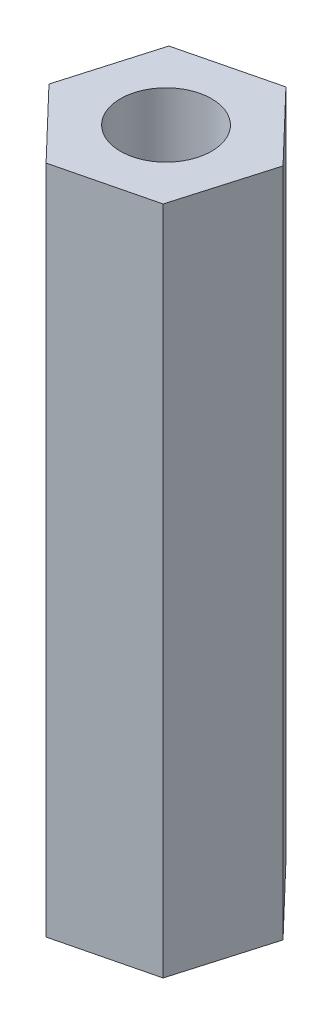
ISO-10303-21;
HEADER;
FILE_DESCRIPTION(('STEP AP214'),'2;1');
FILE_NAME('part.step','',(''),(''),'','','');
FILE_SCHEMA(('AUTOMOTIVE_DESIGN { 1 0 10303 214 1 1 1 1 }'));
ENDSEC;
DATA;
#1=APPLICATION_CONTEXT('core data for automotive mechanical design processes');
#2=APPLICATION_PROTOCOL_DEFINITION('international standard','automotive_design',2000,#1);
#3=PRODUCT_CONTEXT('',#1,'mechanical');
#4=PRODUCT('Part','Part','',(#3));
#5=PRODUCT_RELATED_PRODUCT_CATEGORY('part','',(#4));
#6=PRODUCT_DEFINITION_FORMATION('','',#4);
#7=PRODUCT_DEFINITION_CONTEXT('part definition',#1,'design');
#8=PRODUCT_DEFINITION('design','',#6,#7);
#9=PRODUCT_DEFINITION_SHAPE('','',#8);
#10=(LENGTH_UNIT() NAMED_UNIT(*) SI_UNIT(.MILLI.,.METRE.));
#11=(NAMED_UNIT(*) PLANE_ANGLE_UNIT() SI_UNIT($,.RADIAN.));
#12=(NAMED_UNIT(*) SI_UNIT($,.STERADIAN.) SOLID_ANGLE_UNIT());
#13=UNCERTAINTY_MEASURE_WITH_UNIT(LENGTH_MEASURE(1.E-05),#10,'distance_accuracy_value','');
#14=(GEOMETRIC_REPRESENTATION_CONTEXT(3) GLOBAL_UNCERTAINTY_ASSIGNED_CONTEXT((#13)) GLOBAL_UNIT_ASSIGNED_CONTEXT((#10,
#11,#12)) REPRESENTATION_CONTEXT('',''));
#15=CARTESIAN_POINT('',(0.,0.,0.));
#16=DIRECTION('',(0.,0.,1.));
#17=DIRECTION('',(1.,0.,0.));
#18=AXIS2_PLACEMENT_3D('',#15,#16,#17);
#19=CARTESIAN_POINT('',(-6.32811130994487,25.4,-2.46052037020981));
#20=DIRECTION('',(-0.238502387947703,0.,-0.971141910815944));
#21=DIRECTION('',(-0.971141910815944,0.,0.238502387947703));
#22=AXIS2_PLACEMENT_3D('',#19,#20,#21);
#23=PLANE('',#22);
#24=DIRECTION('',(0.971141910815944,0.,-0.238502387947703));
#25=VECTOR('',#24,1.);
#26=CARTESIAN_POINT('',(-6.32811130994487,0.,-2.46052037020981));
#27=LINE('',#26,#25);
#28=CARTESIAN_POINT('',(-6.32811130994487,0.,-2.46052037020981));
#29=VERTEX_POINT('',#28);
#30=CARTESIAN_POINT('',(-2.76773588288857,0.,-3.33491167377304));
#31=VERTEX_POINT('',#30);
#32=EDGE_CURVE('E121',#29,#31,#27,.T.);
#33=ORIENTED_EDGE('',*,*,#32,.T.);
#34=DIRECTION('',(0.,-1.,0.));
#35=VECTOR('',#34,1.);
#36=CARTESIAN_POINT('',(-2.76773588288857,25.4,-3.33491167377304));
#37=LINE('',#36,#35);
#38=CARTESIAN_POINT('',(-2.76773588288857,25.4,-3.33491167377304));
#39=VERTEX_POINT('',#38);
#40=EDGE_CURVE('E11',#39,#31,#37,.T.);
#41=ORIENTED_EDGE('',*,*,#40,.F.);
#42=DIRECTION('',(0.971141910815944,0.,-0.238502387947703));
#43=VECTOR('',#42,1.);
#44=CARTESIAN_POINT('',(-6.32811130994487,25.4,-2.46052037020981));
#45=LINE('',#44,#43);
#46=CARTESIAN_POINT('',(-6.32811130994487,25.4,-2.46052037020981));
#47=VERTEX_POINT('',#46);
#48=EDGE_CURVE('E132',#47,#39,#45,.T.);
#49=ORIENTED_EDGE('',*,*,#48,.F.);
#50=DIRECTION('',(0.,-1.,0.));
#51=VECTOR('',#50,1.);
#52=CARTESIAN_POINT('',(-6.32811130994487,25.4,-2.46052037020981));
#53=LINE('',#52,#51);
#54=EDGE_CURVE('E117',#47,#29,#53,.T.);
#55=ORIENTED_EDGE('',*,*,#54,.T.);
#56=EDGE_LOOP('',(#33,#41,#49,#55));
#57=FACE_BOUND('',#56,.T.);
#58=ADVANCED_FACE('F37',(#57),#23,.F.);
#59=CARTESIAN_POINT('',(-2.76773588288857,25.4,-3.33491167377304));
#60=DIRECTION('',(-0.960284759420221,0.,-0.279021828582011));
#61=DIRECTION('',(-0.279021828582011,0.,0.960284759420221));
#62=AXIS2_PLACEMENT_3D('',#59,#60,#61);
#63=PLANE('',#62);
#64=DIRECTION('',(0.279021828582011,0.,-0.960284759420221));
#65=VECTOR('',#64,1.);
#66=CARTESIAN_POINT('',(-2.76773588288857,0.,-3.33491167377304));
#67=LINE('',#66,#65);
#68=CARTESIAN_POINT('',(-1.74479325109438,0.,-6.85548289239529));
#69=VERTEX_POINT('',#68);
#70=EDGE_CURVE('E124',#31,#69,#67,.T.);
#71=ORIENTED_EDGE('',*,*,#70,.T.);
#72=DIRECTION('',(0.,-1.,0.));
#73=VECTOR('',#72,1.);
#74=CARTESIAN_POINT('',(-1.74479325109438,25.4,-6.85548289239529));
#75=LINE('',#74,#73);
#76=CARTESIAN_POINT('',(-1.74479325109438,25.4,-6.85548289239529));
#77=VERTEX_POINT('',#76);
#78=EDGE_CURVE('E45',#77,#69,#75,.T.);
#79=ORIENTED_EDGE('',*,*,#78,.F.);
#80=DIRECTION('',(0.279021828582011,0.,-0.960284759420221));
#81=VECTOR('',#80,1.);
#82=CARTESIAN_POINT('',(-2.76773588288857,25.4,-3.33491167377304));
#83=LINE('',#82,#81);
#84=EDGE_CURVE('E90',#39,#77,#83,.T.);
#85=ORIENTED_EDGE('',*,*,#84,.F.);
#86=ORIENTED_EDGE('',*,*,#40,.T.);
#87=EDGE_LOOP('',(#71,#79,#85,#86));
#88=FACE_BOUND('',#87,.T.);
#89=ADVANCED_FACE('F157',(#88),#63,.F.);
#90=CARTESIAN_POINT('',(-1.74479325109438,25.4,-6.85548289239529));
#91=DIRECTION('',(-0.721782371472518,0.,0.692120082233934));
#92=DIRECTION('',(0.692120082233934,0.,0.721782371472518));
#93=AXIS2_PLACEMENT_3D('',#90,#91,#92);
#94=PLANE('',#93);
#95=DIRECTION('',(-0.692120082233934,0.,-0.721782371472518));
#96=VECTOR('',#95,1.);
#97=CARTESIAN_POINT('',(-1.74479325109438,0.,-6.85548289239529));
#98=LINE('',#97,#96);
#99=CARTESIAN_POINT('',(-4.28222604635648,0.,-9.50166280745429));
#100=VERTEX_POINT('',#99);
#101=EDGE_CURVE('E127',#69,#100,#98,.T.);
#102=ORIENTED_EDGE('',*,*,#101,.T.);
#103=DIRECTION('',(0.,-1.,0.));
#104=VECTOR('',#103,1.);
#105=CARTESIAN_POINT('',(-4.28222604635648,25.4,-9.50166280745429));
#106=LINE('',#105,#104);
#107=CARTESIAN_POINT('',(-4.28222604635648,25.4,-9.50166280745429));
#108=VERTEX_POINT('',#107);
#109=EDGE_CURVE('E112',#108,#100,#106,.T.);
#110=ORIENTED_EDGE('',*,*,#109,.F.);
#111=DIRECTION('',(-0.692120082233934,0.,-0.721782371472518));
#112=VECTOR('',#111,1.);
#113=CARTESIAN_POINT('',(-1.74479325109438,25.4,-6.85548289239529));
#114=LINE('',#113,#112);
#115=EDGE_CURVE('E103',#77,#108,#114,.T.);
#116=ORIENTED_EDGE('',*,*,#115,.F.);
#117=ORIENTED_EDGE('',*,*,#78,.T.);
#118=EDGE_LOOP('',(#102,#110,#116,#117));
#119=FACE_BOUND('',#118,.T.);
#120=ADVANCED_FACE('F138',(#119),#94,.F.);
#121=CARTESIAN_POINT('',(-4.28222604635648,25.4,-9.50166280745429));
#122=DIRECTION('',(0.238502387947701,0.,0.971141910815945));
#123=DIRECTION('',(0.971141910815945,0.,-0.238502387947701));
#124=AXIS2_PLACEMENT_3D('',#121,#122,#123);
#125=PLANE('',#124);
#126=DIRECTION('',(-0.971141910815945,0.,0.238502387947701));
#127=VECTOR('',#126,1.);
#128=CARTESIAN_POINT('',(-4.28222604635648,0.,-9.50166280745429));
#129=LINE('',#128,#127);
#130=CARTESIAN_POINT('',(-7.84260147341278,0.,-8.62727150389105));
#131=VERTEX_POINT('',#130);
#132=EDGE_CURVE('E111',#100,#131,#129,.T.);
#133=ORIENTED_EDGE('',*,*,#132,.T.);
#134=DIRECTION('',(0.,-1.,0.));
#135=VECTOR('',#134,1.);
#136=CARTESIAN_POINT('',(-7.84260147341278,25.4,-8.62727150389105));
#137=LINE('',#136,#135);
#138=CARTESIAN_POINT('',(-7.84260147341278,25.4,-8.62727150389105));
#139=VERTEX_POINT('',#138);
#140=EDGE_CURVE('E108',#139,#131,#137,.T.);
#141=ORIENTED_EDGE('',*,*,#140,.F.);
#142=DIRECTION('',(-0.971141910815945,0.,0.238502387947701));
#143=VECTOR('',#142,1.);
#144=CARTESIAN_POINT('',(-4.28222604635648,25.4,-9.50166280745429));
#145=LINE('',#144,#143);
#146=EDGE_CURVE('E97',#108,#139,#145,.T.);
#147=ORIENTED_EDGE('',*,*,#146,.F.);
#148=ORIENTED_EDGE('',*,*,#109,.T.);
#149=EDGE_LOOP('',(#133,#141,#147,#148));
#150=FACE_BOUND('',#149,.T.);
#151=ADVANCED_FACE('F109',(#150),#125,.F.);
#152=CARTESIAN_POINT('',(-7.84260147341278,25.4,-8.62727150389105));
#153=DIRECTION('',(0.960284759420221,0.,0.27902182858201));
#154=DIRECTION('',(0.27902182858201,0.,-0.960284759420221));
#155=AXIS2_PLACEMENT_3D('',#152,#153,#154);
#156=PLANE('',#155);
#157=DIRECTION('',(-0.27902182858201,0.,0.960284759420221));
#158=VECTOR('',#157,1.);
#159=CARTESIAN_POINT('',(-7.84260147341278,0.,-8.62727150389105));
#160=LINE('',#159,#158);
#161=CARTESIAN_POINT('',(-8.86554410520697,0.,-5.10670028526881));
#162=VERTEX_POINT('',#161);
#163=EDGE_CURVE('E76',#131,#162,#160,.T.);
#164=ORIENTED_EDGE('',*,*,#163,.T.);
#165=DIRECTION('',(0.,-1.,0.));
#166=VECTOR('',#165,1.);
#167=CARTESIAN_POINT('',(-8.86554410520697,25.4,-5.10670028526881));
#168=LINE('',#167,#166);
#169=CARTESIAN_POINT('',(-8.86554410520697,25.4,-5.10670028526881));
#170=VERTEX_POINT('',#169);
#171=EDGE_CURVE('E113',#170,#162,#168,.T.);
#172=ORIENTED_EDGE('',*,*,#171,.F.);
#173=DIRECTION('',(-0.27902182858201,0.,0.960284759420221));
#174=VECTOR('',#173,1.);
#175=CARTESIAN_POINT('',(-7.84260147341278,25.4,-8.62727150389105));
#176=LINE('',#175,#174);
#177=EDGE_CURVE('E101',#139,#170,#176,.T.);
#178=ORIENTED_EDGE('',*,*,#177,.F.);
#179=ORIENTED_EDGE('',*,*,#140,.T.);
#180=EDGE_LOOP('',(#164,#172,#178,#179));
#181=FACE_BOUND('',#180,.T.);
#182=ADVANCED_FACE('F115',(#181),#156,.F.);
#183=CARTESIAN_POINT('',(-8.86554410520697,25.4,-5.10670028526881));
#184=DIRECTION('',(0.721782371472518,0.,-0.692120082233934));
#185=DIRECTION('',(-0.692120082233934,0.,-0.721782371472518));
#186=AXIS2_PLACEMENT_3D('',#183,#184,#185);
#187=PLANE('',#186);
#188=DIRECTION('',(0.692120082233934,0.,0.721782371472518));
#189=VECTOR('',#188,1.);
#190=CARTESIAN_POINT('',(-8.86554410520697,0.,-5.10670028526881));
#191=LINE('',#190,#189);
#192=EDGE_CURVE('E82',#162,#29,#191,.T.);
#193=ORIENTED_EDGE('',*,*,#192,.T.);
#194=ORIENTED_EDGE('',*,*,#54,.F.);
#195=DIRECTION('',(0.692120082233934,0.,0.721782371472518));
#196=VECTOR('',#195,1.);
#197=CARTESIAN_POINT('',(-8.86554410520697,25.4,-5.10670028526881));
#198=LINE('',#197,#196);
#199=EDGE_CURVE('E53',#170,#47,#198,.T.);
#200=ORIENTED_EDGE('',*,*,#199,.F.);
#201=ORIENTED_EDGE('',*,*,#171,.T.);
#202=EDGE_LOOP('',(#193,#194,#200,#201));
#203=FACE_BOUND('',#202,.T.);
#204=ADVANCED_FACE('F145',(#203),#187,.F.);
#205=CARTESIAN_POINT('',(0.,25.4,0.));
#206=DIRECTION('',(0.,1.,0.));
#207=DIRECTION('',(0.,0.,1.));
#208=AXIS2_PLACEMENT_3D('',#205,#206,#207);
#209=PLANE('',#208);
#210=CARTESIAN_POINT('',(-5.30516867815067,25.4,-5.98109158883205));
#211=DIRECTION('',(0.,-1.,0.));
#212=DIRECTION('',(0.,0.,-1.));
#213=AXIS2_PLACEMENT_3D('',#210,#211,#212);
#214=CIRCLE('',#213,1.7272);
#215=CARTESIAN_POINT('',(-5.30516867815067,25.4,-7.70829158883205));
#216=VERTEX_POINT('',#215);
#217=EDGE_CURVE('E125',#216,#216,#214,.T.);
#218=ORIENTED_EDGE('',*,*,#217,.T.);
#219=EDGE_LOOP('',(#218));
#220=FACE_BOUND('',#219,.T.);
#221=ORIENTED_EDGE('',*,*,#48,.T.);
#222=ORIENTED_EDGE('',*,*,#84,.T.);
#223=ORIENTED_EDGE('',*,*,#115,.T.);
#224=ORIENTED_EDGE('',*,*,#146,.T.);
#225=ORIENTED_EDGE('',*,*,#177,.T.);
#226=ORIENTED_EDGE('',*,*,#199,.T.);
#227=EDGE_LOOP('',(#221,#222,#223,#224,#225,#226));
#228=FACE_BOUND('',#227,.T.);
#229=ADVANCED_FACE('F99',(#220,#228),#209,.T.);
#230=CARTESIAN_POINT('',(0.,0.,0.));
#231=DIRECTION('',(0.,1.,0.));
#232=DIRECTION('',(0.,0.,1.));
#233=AXIS2_PLACEMENT_3D('',#230,#231,#232);
#234=PLANE('',#233);
#235=CARTESIAN_POINT('',(-5.30516867815067,0.,-5.98109158883205));
#236=DIRECTION('',(0.,-1.,0.));
#237=DIRECTION('',(0.,0.,-1.));
#238=AXIS2_PLACEMENT_3D('',#235,#236,#237);
#239=CIRCLE('',#238,1.7272);
#240=CARTESIAN_POINT('',(-5.30516867815067,0.,-7.70829158883205));
#241=VERTEX_POINT('',#240);
#242=EDGE_CURVE('E241',#241,#241,#239,.T.);
#243=ORIENTED_EDGE('',*,*,#242,.F.);
#244=EDGE_LOOP('',(#243));
#245=FACE_BOUND('',#244,.T.);
#246=ORIENTED_EDGE('',*,*,#32,.F.);
#247=ORIENTED_EDGE('',*,*,#192,.F.);
#248=ORIENTED_EDGE('',*,*,#163,.F.);
#249=ORIENTED_EDGE('',*,*,#132,.F.);
#250=ORIENTED_EDGE('',*,*,#101,.F.);
#251=ORIENTED_EDGE('',*,*,#70,.F.);
#252=EDGE_LOOP('',(#246,#247,#248,#249,#250,#251));
#253=FACE_BOUND('',#252,.T.);
#254=ADVANCED_FACE('F141',(#245,#253),#234,.F.);
#255=CARTESIAN_POINT('',(-5.30516867815067,25.4,-5.98109158883205));
#256=DIRECTION('',(0.,-1.,0.));
#257=DIRECTION('',(0.,0.,-1.));
#258=AXIS2_PLACEMENT_3D('',#255,#256,#257);
#259=CYLINDRICAL_SURFACE('',#258,1.7272);
#260=ORIENTED_EDGE('',*,*,#217,.F.);
#261=EDGE_LOOP('',(#260));
#262=FACE_BOUND('',#261,.T.);
#263=ORIENTED_EDGE('',*,*,#242,.T.);
#264=EDGE_LOOP('',(#263));
#265=FACE_BOUND('',#264,.T.);
#266=ADVANCED_FACE('F185',(#262,#265),#259,.F.);
#267=CLOSED_SHELL('',(#58,#89,#120,#151,#182,#204,#229,#254,#266));
#268=MANIFOLD_SOLID_BREP('B2',#267);
#269=ADVANCED_BREP_SHAPE_REPRESENTATION('',(#18,#268),#14);
#270=SHAPE_DEFINITION_REPRESENTATION(#9,#269);
ENDSEC;
END-ISO-10303-21;
